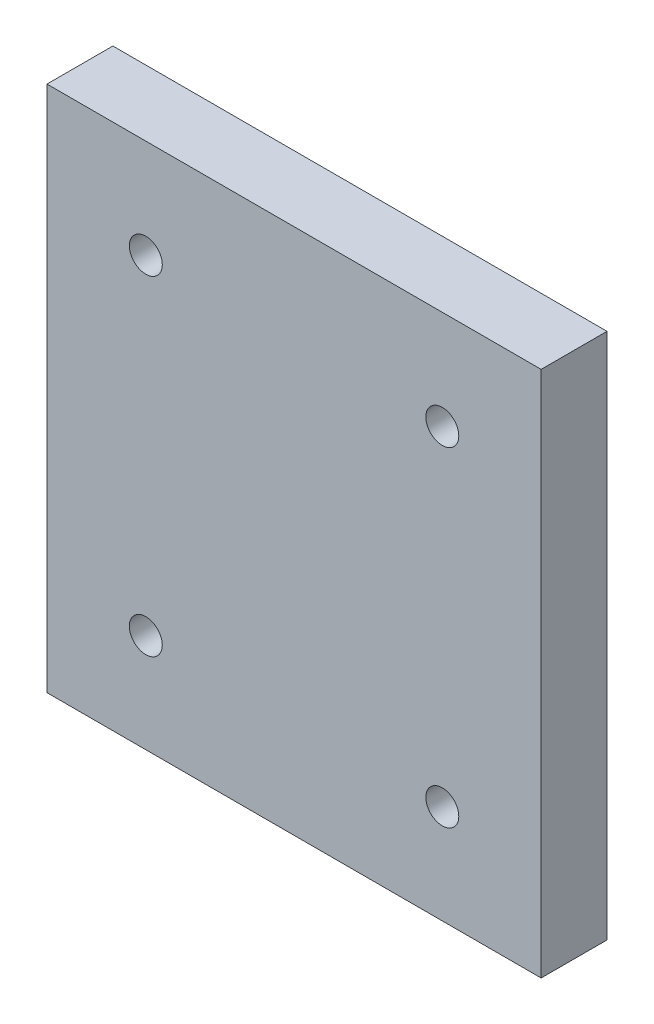
ISO-10303-21;
HEADER;
FILE_DESCRIPTION(('STEP AP214'),'2;1');
FILE_NAME('part.step','',(''),(''),'','','');
FILE_SCHEMA(('AUTOMOTIVE_DESIGN { 1 0 10303 214 1 1 1 1 }'));
ENDSEC;
DATA;
#1=APPLICATION_CONTEXT('core data for automotive mechanical design processes');
#2=APPLICATION_PROTOCOL_DEFINITION('international standard','automotive_design',2000,#1);
#3=PRODUCT_CONTEXT('',#1,'mechanical');
#4=PRODUCT('Part','Part','',(#3));
#5=PRODUCT_RELATED_PRODUCT_CATEGORY('part','',(#4));
#6=PRODUCT_DEFINITION_FORMATION('','',#4);
#7=PRODUCT_DEFINITION_CONTEXT('part definition',#1,'design');
#8=PRODUCT_DEFINITION('design','',#6,#7);
#9=PRODUCT_DEFINITION_SHAPE('','',#8);
#10=(LENGTH_UNIT() NAMED_UNIT(*) SI_UNIT(.MILLI.,.METRE.));
#11=(NAMED_UNIT(*) PLANE_ANGLE_UNIT() SI_UNIT($,.RADIAN.));
#12=(NAMED_UNIT(*) SI_UNIT($,.STERADIAN.) SOLID_ANGLE_UNIT());
#13=UNCERTAINTY_MEASURE_WITH_UNIT(LENGTH_MEASURE(1.E-05),#10,'distance_accuracy_value','');
#14=(GEOMETRIC_REPRESENTATION_CONTEXT(3) GLOBAL_UNCERTAINTY_ASSIGNED_CONTEXT((#13)) GLOBAL_UNIT_ASSIGNED_CONTEXT((#10,
#11,#12)) REPRESENTATION_CONTEXT('',''));
#15=CARTESIAN_POINT('',(0.,0.,0.));
#16=DIRECTION('',(0.,0.,1.));
#17=DIRECTION('',(1.,0.,0.));
#18=AXIS2_PLACEMENT_3D('',#15,#16,#17);
#19=CARTESIAN_POINT('',(65.,0.,10.));
#20=DIRECTION('',(1.,0.,0.));
#21=DIRECTION('',(0.,0.,-1.));
#22=AXIS2_PLACEMENT_3D('',#19,#20,#21);
#23=PLANE('',#22);
#24=DIRECTION('',(0.,-1.,0.));
#25=VECTOR('',#24,1.);
#26=CARTESIAN_POINT('',(65.,0.,0.));
#27=LINE('',#26,#25);
#28=CARTESIAN_POINT('',(65.,70.,0.));
#29=VERTEX_POINT('',#28);
#30=CARTESIAN_POINT('',(65.,-10.,0.));
#31=VERTEX_POINT('',#30);
#32=EDGE_CURVE('E121',#29,#31,#27,.T.);
#33=ORIENTED_EDGE('',*,*,#32,.F.);
#34=DIRECTION('',(0.,0.,-1.));
#35=VECTOR('',#34,1.);
#36=CARTESIAN_POINT('',(65.,70.,10.));
#37=LINE('',#36,#35);
#38=CARTESIAN_POINT('',(65.,70.,10.));
#39=VERTEX_POINT('',#38);
#40=EDGE_CURVE('E11',#39,#29,#37,.T.);
#41=ORIENTED_EDGE('',*,*,#40,.F.);
#42=DIRECTION('',(0.,-1.,0.));
#43=VECTOR('',#42,1.);
#44=CARTESIAN_POINT('',(65.,0.,10.));
#45=LINE('',#44,#43);
#46=CARTESIAN_POINT('',(65.,-10.,10.));
#47=VERTEX_POINT('',#46);
#48=EDGE_CURVE('E98',#39,#47,#45,.T.);
#49=ORIENTED_EDGE('',*,*,#48,.T.);
#50=DIRECTION('',(0.,0.,-1.));
#51=VECTOR('',#50,1.);
#52=CARTESIAN_POINT('',(65.,-10.,10.));
#53=LINE('',#52,#51);
#54=EDGE_CURVE('E59',#47,#31,#53,.T.);
#55=ORIENTED_EDGE('',*,*,#54,.T.);
#56=EDGE_LOOP('',(#33,#41,#49,#55));
#57=FACE_BOUND('',#56,.T.);
#58=ADVANCED_FACE('F41',(#57),#23,.T.);
#59=CARTESIAN_POINT('',(0.,70.,10.));
#60=DIRECTION('',(0.,-1.,0.));
#61=DIRECTION('',(0.,0.,-1.));
#62=AXIS2_PLACEMENT_3D('',#59,#60,#61);
#63=PLANE('',#62);
#64=DIRECTION('',(-1.,0.,0.));
#65=VECTOR('',#64,1.);
#66=CARTESIAN_POINT('',(0.,70.,0.));
#67=LINE('',#66,#65);
#68=CARTESIAN_POINT('',(-10.,70.,0.));
#69=VERTEX_POINT('',#68);
#70=EDGE_CURVE('E104',#29,#69,#67,.T.);
#71=ORIENTED_EDGE('',*,*,#70,.T.);
#72=DIRECTION('',(0.,0.,-1.));
#73=VECTOR('',#72,1.);
#74=CARTESIAN_POINT('',(-10.,70.,10.));
#75=LINE('',#74,#73);
#76=CARTESIAN_POINT('',(-10.,70.,10.));
#77=VERTEX_POINT('',#76);
#78=EDGE_CURVE('E51',#77,#69,#75,.T.);
#79=ORIENTED_EDGE('',*,*,#78,.F.);
#80=DIRECTION('',(-1.,0.,0.));
#81=VECTOR('',#80,1.);
#82=CARTESIAN_POINT('',(0.,70.,10.));
#83=LINE('',#82,#81);
#84=EDGE_CURVE('E94',#39,#77,#83,.T.);
#85=ORIENTED_EDGE('',*,*,#84,.F.);
#86=ORIENTED_EDGE('',*,*,#40,.T.);
#87=EDGE_LOOP('',(#71,#79,#85,#86));
#88=FACE_BOUND('',#87,.T.);
#89=ADVANCED_FACE('F102',(#88),#63,.F.);
#90=CARTESIAN_POINT('',(-10.,0.,10.));
#91=DIRECTION('',(1.,0.,0.));
#92=DIRECTION('',(0.,1.,0.));
#93=AXIS2_PLACEMENT_3D('',#90,#91,#92);
#94=PLANE('',#93);
#95=DIRECTION('',(0.,-1.,0.));
#96=VECTOR('',#95,1.);
#97=CARTESIAN_POINT('',(-10.,0.,0.));
#98=LINE('',#97,#96);
#99=CARTESIAN_POINT('',(-10.,-10.,0.));
#100=VERTEX_POINT('',#99);
#101=EDGE_CURVE('E116',#69,#100,#98,.T.);
#102=ORIENTED_EDGE('',*,*,#101,.T.);
#103=DIRECTION('',(0.,0.,-1.));
#104=VECTOR('',#103,1.);
#105=CARTESIAN_POINT('',(-10.,-10.,10.));
#106=LINE('',#105,#104);
#107=CARTESIAN_POINT('',(-10.,-10.,10.));
#108=VERTEX_POINT('',#107);
#109=EDGE_CURVE('E73',#108,#100,#106,.T.);
#110=ORIENTED_EDGE('',*,*,#109,.F.);
#111=DIRECTION('',(0.,-1.,0.));
#112=VECTOR('',#111,1.);
#113=CARTESIAN_POINT('',(-10.,0.,10.));
#114=LINE('',#113,#112);
#115=EDGE_CURVE('E85',#77,#108,#114,.T.);
#116=ORIENTED_EDGE('',*,*,#115,.F.);
#117=ORIENTED_EDGE('',*,*,#78,.T.);
#118=EDGE_LOOP('',(#102,#110,#116,#117));
#119=FACE_BOUND('',#118,.T.);
#120=ADVANCED_FACE('F87',(#119),#94,.F.);
#121=CARTESIAN_POINT('',(50.,55.,10.));
#122=DIRECTION('',(0.,0.,-1.));
#123=DIRECTION('',(-1.,0.,0.));
#124=AXIS2_PLACEMENT_3D('',#121,#122,#123);
#125=CYLINDRICAL_SURFACE('',#124,2.5);
#126=CARTESIAN_POINT('',(50.,55.,10.));
#127=DIRECTION('',(0.,0.,1.));
#128=DIRECTION('',(1.,0.,0.));
#129=AXIS2_PLACEMENT_3D('',#126,#127,#128);
#130=CIRCLE('',#129,2.5);
#131=CARTESIAN_POINT('',(52.5,55.,10.));
#132=VERTEX_POINT('',#131);
#133=EDGE_CURVE('E144',#132,#132,#130,.T.);
#134=ORIENTED_EDGE('',*,*,#133,.T.);
#135=EDGE_LOOP('',(#134));
#136=FACE_BOUND('',#135,.T.);
#137=CARTESIAN_POINT('',(50.,55.,0.));
#138=DIRECTION('',(0.,0.,1.));
#139=DIRECTION('',(1.,0.,0.));
#140=AXIS2_PLACEMENT_3D('',#137,#138,#139);
#141=CIRCLE('',#140,2.5);
#142=CARTESIAN_POINT('',(52.5,55.,0.));
#143=VERTEX_POINT('',#142);
#144=EDGE_CURVE('E124',#143,#143,#141,.T.);
#145=ORIENTED_EDGE('',*,*,#144,.F.);
#146=EDGE_LOOP('',(#145));
#147=FACE_BOUND('',#146,.T.);
#148=ADVANCED_FACE('F173',(#136,#147),#125,.F.);
#149=CARTESIAN_POINT('',(5.,55.,10.));
#150=DIRECTION('',(0.,0.,-1.));
#151=DIRECTION('',(-1.,0.,0.));
#152=AXIS2_PLACEMENT_3D('',#149,#150,#151);
#153=CYLINDRICAL_SURFACE('',#152,2.5);
#154=CARTESIAN_POINT('',(5.,55.,10.));
#155=DIRECTION('',(0.,0.,1.));
#156=DIRECTION('',(1.,0.,0.));
#157=AXIS2_PLACEMENT_3D('',#154,#155,#156);
#158=CIRCLE('',#157,2.5);
#159=CARTESIAN_POINT('',(7.5,55.,10.));
#160=VERTEX_POINT('',#159);
#161=EDGE_CURVE('E148',#160,#160,#158,.T.);
#162=ORIENTED_EDGE('',*,*,#161,.T.);
#163=EDGE_LOOP('',(#162));
#164=FACE_BOUND('',#163,.T.);
#165=CARTESIAN_POINT('',(5.,55.,0.));
#166=DIRECTION('',(0.,0.,1.));
#167=DIRECTION('',(1.,0.,0.));
#168=AXIS2_PLACEMENT_3D('',#165,#166,#167);
#169=CIRCLE('',#168,2.5);
#170=CARTESIAN_POINT('',(7.5,55.,0.));
#171=VERTEX_POINT('',#170);
#172=EDGE_CURVE('E128',#171,#171,#169,.T.);
#173=ORIENTED_EDGE('',*,*,#172,.F.);
#174=EDGE_LOOP('',(#173));
#175=FACE_BOUND('',#174,.T.);
#176=ADVANCED_FACE('F176',(#164,#175),#153,.F.);
#177=CARTESIAN_POINT('',(5.,5.,10.));
#178=DIRECTION('',(0.,0.,-1.));
#179=DIRECTION('',(-1.,0.,0.));
#180=AXIS2_PLACEMENT_3D('',#177,#178,#179);
#181=CYLINDRICAL_SURFACE('',#180,2.5);
#182=CARTESIAN_POINT('',(5.,5.,10.));
#183=DIRECTION('',(0.,0.,1.));
#184=DIRECTION('',(1.,0.,0.));
#185=AXIS2_PLACEMENT_3D('',#182,#183,#184);
#186=CIRCLE('',#185,2.5);
#187=CARTESIAN_POINT('',(7.5,5.,10.));
#188=VERTEX_POINT('',#187);
#189=EDGE_CURVE('E152',#188,#188,#186,.T.);
#190=ORIENTED_EDGE('',*,*,#189,.T.);
#191=EDGE_LOOP('',(#190));
#192=FACE_BOUND('',#191,.T.);
#193=CARTESIAN_POINT('',(5.,5.,0.));
#194=DIRECTION('',(0.,0.,1.));
#195=DIRECTION('',(1.,0.,0.));
#196=AXIS2_PLACEMENT_3D('',#193,#194,#195);
#197=CIRCLE('',#196,2.5);
#198=CARTESIAN_POINT('',(7.5,5.,0.));
#199=VERTEX_POINT('',#198);
#200=EDGE_CURVE('E132',#199,#199,#197,.T.);
#201=ORIENTED_EDGE('',*,*,#200,.F.);
#202=EDGE_LOOP('',(#201));
#203=FACE_BOUND('',#202,.T.);
#204=ADVANCED_FACE('F189',(#192,#203),#181,.F.);
#205=CARTESIAN_POINT('',(50.,5.,10.));
#206=DIRECTION('',(0.,0.,-1.));
#207=DIRECTION('',(-1.,0.,0.));
#208=AXIS2_PLACEMENT_3D('',#205,#206,#207);
#209=CYLINDRICAL_SURFACE('',#208,2.5);
#210=CARTESIAN_POINT('',(50.,5.,10.));
#211=DIRECTION('',(0.,0.,1.));
#212=DIRECTION('',(1.,0.,0.));
#213=AXIS2_PLACEMENT_3D('',#210,#211,#212);
#214=CIRCLE('',#213,2.5);
#215=CARTESIAN_POINT('',(52.5,5.,10.));
#216=VERTEX_POINT('',#215);
#217=EDGE_CURVE('E115',#216,#216,#214,.T.);
#218=ORIENTED_EDGE('',*,*,#217,.T.);
#219=EDGE_LOOP('',(#218));
#220=FACE_BOUND('',#219,.T.);
#221=CARTESIAN_POINT('',(50.,5.,0.));
#222=DIRECTION('',(0.,0.,1.));
#223=DIRECTION('',(1.,0.,0.));
#224=AXIS2_PLACEMENT_3D('',#221,#222,#223);
#225=CIRCLE('',#224,2.5);
#226=CARTESIAN_POINT('',(52.5,5.,0.));
#227=VERTEX_POINT('',#226);
#228=EDGE_CURVE('E136',#227,#227,#225,.T.);
#229=ORIENTED_EDGE('',*,*,#228,.F.);
#230=EDGE_LOOP('',(#229));
#231=FACE_BOUND('',#230,.T.);
#232=ADVANCED_FACE('F43',(#220,#231),#209,.F.);
#233=CARTESIAN_POINT('',(0.,-10.,10.));
#234=DIRECTION('',(0.,-1.,0.));
#235=DIRECTION('',(1.,0.,0.));
#236=AXIS2_PLACEMENT_3D('',#233,#234,#235);
#237=PLANE('',#236);
#238=DIRECTION('',(-1.,0.,0.));
#239=VECTOR('',#238,1.);
#240=CARTESIAN_POINT('',(0.,-10.,0.));
#241=LINE('',#240,#239);
#242=EDGE_CURVE('E111',#31,#100,#241,.T.);
#243=ORIENTED_EDGE('',*,*,#242,.F.);
#244=ORIENTED_EDGE('',*,*,#54,.F.);
#245=DIRECTION('',(-1.,0.,0.));
#246=VECTOR('',#245,1.);
#247=CARTESIAN_POINT('',(0.,-10.,10.));
#248=LINE('',#247,#246);
#249=EDGE_CURVE('E93',#47,#108,#248,.T.);
#250=ORIENTED_EDGE('',*,*,#249,.T.);
#251=ORIENTED_EDGE('',*,*,#109,.T.);
#252=EDGE_LOOP('',(#243,#244,#250,#251));
#253=FACE_BOUND('',#252,.T.);
#254=ADVANCED_FACE('F165',(#253),#237,.T.);
#255=CARTESIAN_POINT('',(0.,0.,10.));
#256=DIRECTION('',(0.,0.,1.));
#257=DIRECTION('',(1.,0.,0.));
#258=AXIS2_PLACEMENT_3D('',#255,#256,#257);
#259=PLANE('',#258);
#260=ORIENTED_EDGE('',*,*,#217,.F.);
#261=EDGE_LOOP('',(#260));
#262=FACE_BOUND('',#261,.T.);
#263=ORIENTED_EDGE('',*,*,#189,.F.);
#264=EDGE_LOOP('',(#263));
#265=FACE_BOUND('',#264,.T.);
#266=ORIENTED_EDGE('',*,*,#161,.F.);
#267=EDGE_LOOP('',(#266));
#268=FACE_BOUND('',#267,.T.);
#269=ORIENTED_EDGE('',*,*,#133,.F.);
#270=EDGE_LOOP('',(#269));
#271=FACE_BOUND('',#270,.T.);
#272=ORIENTED_EDGE('',*,*,#48,.F.);
#273=ORIENTED_EDGE('',*,*,#84,.T.);
#274=ORIENTED_EDGE('',*,*,#115,.T.);
#275=ORIENTED_EDGE('',*,*,#249,.F.);
#276=EDGE_LOOP('',(#272,#273,#274,#275));
#277=FACE_BOUND('',#276,.T.);
#278=ADVANCED_FACE('F97',(#262,#265,#268,#271,#277),#259,.T.);
#279=CARTESIAN_POINT('',(0.,0.,0.));
#280=DIRECTION('',(0.,0.,1.));
#281=DIRECTION('',(1.,0.,0.));
#282=AXIS2_PLACEMENT_3D('',#279,#280,#281);
#283=PLANE('',#282);
#284=ORIENTED_EDGE('',*,*,#228,.T.);
#285=EDGE_LOOP('',(#284));
#286=FACE_BOUND('',#285,.T.);
#287=ORIENTED_EDGE('',*,*,#200,.T.);
#288=EDGE_LOOP('',(#287));
#289=FACE_BOUND('',#288,.T.);
#290=ORIENTED_EDGE('',*,*,#172,.T.);
#291=EDGE_LOOP('',(#290));
#292=FACE_BOUND('',#291,.T.);
#293=ORIENTED_EDGE('',*,*,#144,.T.);
#294=EDGE_LOOP('',(#293));
#295=FACE_BOUND('',#294,.T.);
#296=ORIENTED_EDGE('',*,*,#32,.T.);
#297=ORIENTED_EDGE('',*,*,#242,.T.);
#298=ORIENTED_EDGE('',*,*,#101,.F.);
#299=ORIENTED_EDGE('',*,*,#70,.F.);
#300=EDGE_LOOP('',(#296,#297,#298,#299));
#301=FACE_BOUND('',#300,.T.);
#302=ADVANCED_FACE('F164',(#286,#289,#292,#295,#301),#283,.F.);
#303=CLOSED_SHELL('',(#58,#89,#120,#148,#176,#204,#232,#254,#278,#302));
#304=MANIFOLD_SOLID_BREP('B2',#303);
#305=ADVANCED_BREP_SHAPE_REPRESENTATION('',(#18,#304),#14);
#306=SHAPE_DEFINITION_REPRESENTATION(#9,#305);
ENDSEC;
END-ISO-10303-21;
